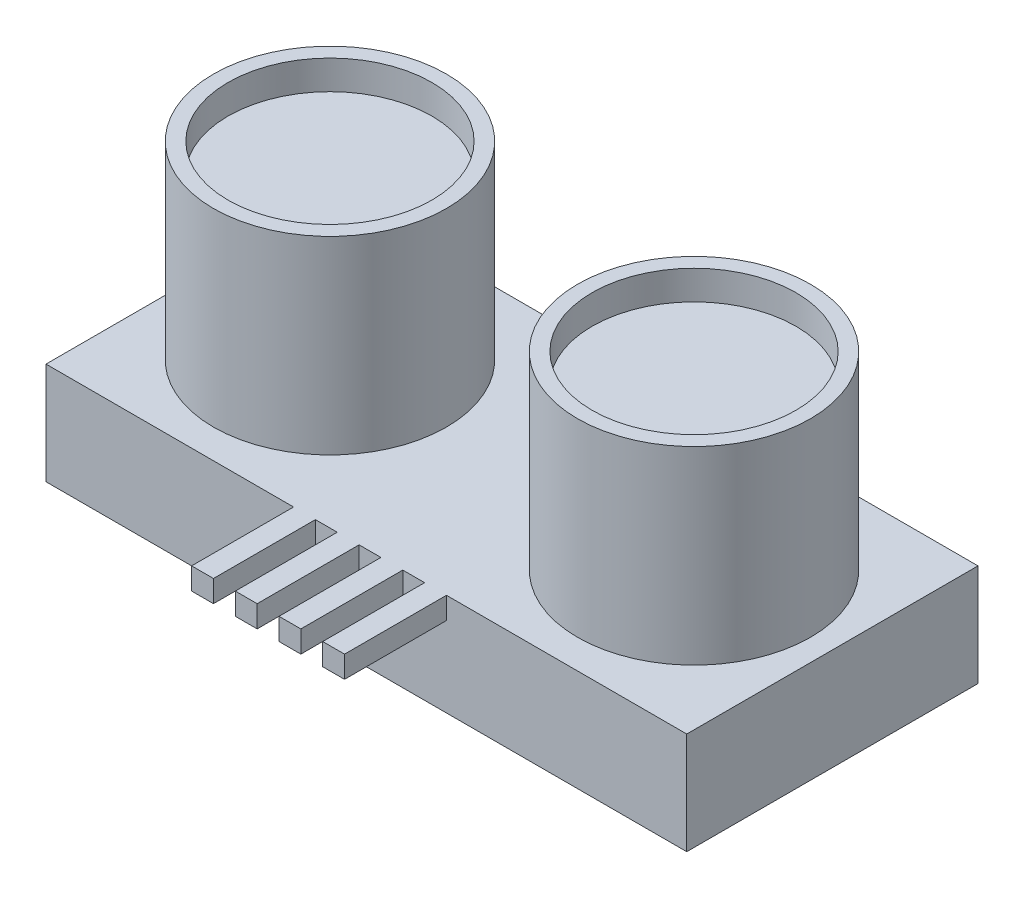
ISO-10303-21;
HEADER;
FILE_DESCRIPTION(('STEP AP214'),'2;1');
FILE_NAME('part.step','',(''),(''),'','','');
FILE_SCHEMA(('AUTOMOTIVE_DESIGN { 1 0 10303 214 1 1 1 1 }'));
ENDSEC;
DATA;
#1=APPLICATION_CONTEXT('core data for automotive mechanical design processes');
#2=APPLICATION_PROTOCOL_DEFINITION('international standard','automotive_design',2000,#1);
#3=PRODUCT_CONTEXT('',#1,'mechanical');
#4=PRODUCT('Part','Part','',(#3));
#5=PRODUCT_RELATED_PRODUCT_CATEGORY('part','',(#4));
#6=PRODUCT_DEFINITION_FORMATION('','',#4);
#7=PRODUCT_DEFINITION_CONTEXT('part definition',#1,'design');
#8=PRODUCT_DEFINITION('design','',#6,#7);
#9=PRODUCT_DEFINITION_SHAPE('','',#8);
#10=(LENGTH_UNIT() NAMED_UNIT(*) SI_UNIT(.MILLI.,.METRE.));
#11=(NAMED_UNIT(*) PLANE_ANGLE_UNIT() SI_UNIT($,.RADIAN.));
#12=(NAMED_UNIT(*) SI_UNIT($,.STERADIAN.) SOLID_ANGLE_UNIT());
#13=UNCERTAINTY_MEASURE_WITH_UNIT(LENGTH_MEASURE(1.E-05),#10,'distance_accuracy_value','');
#14=(GEOMETRIC_REPRESENTATION_CONTEXT(3) GLOBAL_UNCERTAINTY_ASSIGNED_CONTEXT((#13)) GLOBAL_UNIT_ASSIGNED_CONTEXT((#10,
#11,#12)) REPRESENTATION_CONTEXT('',''));
#15=CARTESIAN_POINT('',(0.,0.,0.));
#16=DIRECTION('',(0.,0.,1.));
#17=DIRECTION('',(1.,0.,0.));
#18=AXIS2_PLACEMENT_3D('',#15,#16,#17);
#19=CARTESIAN_POINT('',(-25.6809338521401,7.,4.84824902723736));
#20=DIRECTION('',(0.,0.,-1.));
#21=DIRECTION('',(-1.,0.,0.));
#22=AXIS2_PLACEMENT_3D('',#19,#20,#21);
#23=PLANE('',#22);
#24=DIRECTION('',(0.,-1.,0.));
#25=VECTOR('',#24,1.);
#26=CARTESIAN_POINT('',(0.319066147859932,7.,4.84824902723736));
#27=LINE('',#26,#25);
#28=CARTESIAN_POINT('',(0.319066147859932,7.,4.84824902723736));
#29=VERTEX_POINT('',#28);
#30=CARTESIAN_POINT('',(0.319066147859932,5.5,4.84824902723736));
#31=VERTEX_POINT('',#30);
#32=EDGE_CURVE('E196',#29,#31,#27,.T.);
#33=ORIENTED_EDGE('',*,*,#32,.F.);
#34=DIRECTION('',(1.,0.,0.));
#35=VECTOR('',#34,1.);
#36=CARTESIAN_POINT('',(-25.6809338521401,7.,4.84824902723736));
#37=LINE('',#36,#35);
#38=CARTESIAN_POINT('',(-1.18093385214007,7.,4.84824902723736));
#39=VERTEX_POINT('',#38);
#40=EDGE_CURVE('E285',#39,#29,#37,.T.);
#41=ORIENTED_EDGE('',*,*,#40,.F.);
#42=DIRECTION('',(0.,1.,0.));
#43=VECTOR('',#42,1.);
#44=CARTESIAN_POINT('',(-1.18093385214007,7.,4.84824902723736));
#45=LINE('',#44,#43);
#46=CARTESIAN_POINT('',(-1.18093385214007,5.5,4.84824902723736));
#47=VERTEX_POINT('',#46);
#48=EDGE_CURVE('E210',#47,#39,#45,.T.);
#49=ORIENTED_EDGE('',*,*,#48,.F.);
#50=DIRECTION('',(1.,0.,0.));
#51=VECTOR('',#50,1.);
#52=CARTESIAN_POINT('',(-2.68093385214007,5.5,4.84824902723736));
#53=LINE('',#52,#51);
#54=CARTESIAN_POINT('',(-2.68093385214007,5.5,4.84824902723736));
#55=VERTEX_POINT('',#54);
#56=EDGE_CURVE('E201',#55,#47,#53,.T.);
#57=ORIENTED_EDGE('',*,*,#56,.F.);
#58=DIRECTION('',(0.,-1.,0.));
#59=VECTOR('',#58,1.);
#60=CARTESIAN_POINT('',(-2.68093385214007,7.,4.84824902723736));
#61=LINE('',#60,#59);
#62=CARTESIAN_POINT('',(-2.68093385214007,7.,4.84824902723736));
#63=VERTEX_POINT('',#62);
#64=EDGE_CURVE('E198',#63,#55,#61,.T.);
#65=ORIENTED_EDGE('',*,*,#64,.F.);
#66=CARTESIAN_POINT('',(-4.18093385214007,7.,4.84824902723736));
#67=VERTEX_POINT('',#66);
#68=EDGE_CURVE('E282',#67,#63,#37,.T.);
#69=ORIENTED_EDGE('',*,*,#68,.F.);
#70=DIRECTION('',(0.,1.,0.));
#71=VECTOR('',#70,1.);
#72=CARTESIAN_POINT('',(-4.18093385214007,7.,4.84824902723736));
#73=LINE('',#72,#71);
#74=CARTESIAN_POINT('',(-4.18093385214007,5.5,4.84824902723736));
#75=VERTEX_POINT('',#74);
#76=EDGE_CURVE('E231',#75,#67,#73,.T.);
#77=ORIENTED_EDGE('',*,*,#76,.F.);
#78=DIRECTION('',(1.,0.,0.));
#79=VECTOR('',#78,1.);
#80=CARTESIAN_POINT('',(-5.68093385214007,5.5,4.84824902723736));
#81=LINE('',#80,#79);
#82=CARTESIAN_POINT('',(-5.68093385214007,5.5,4.84824902723736));
#83=VERTEX_POINT('',#82);
#84=EDGE_CURVE('E240',#83,#75,#81,.T.);
#85=ORIENTED_EDGE('',*,*,#84,.F.);
#86=DIRECTION('',(0.,-1.,0.));
#87=VECTOR('',#86,1.);
#88=CARTESIAN_POINT('',(-5.68093385214007,7.,4.84824902723736));
#89=LINE('',#88,#87);
#90=CARTESIAN_POINT('',(-5.68093385214007,7.,4.84824902723736));
#91=VERTEX_POINT('',#90);
#92=EDGE_CURVE('E226',#91,#83,#89,.T.);
#93=ORIENTED_EDGE('',*,*,#92,.F.);
#94=CARTESIAN_POINT('',(-7.18093385214007,7.,4.84824902723736));
#95=VERTEX_POINT('',#94);
#96=EDGE_CURVE('E284',#95,#91,#37,.T.);
#97=ORIENTED_EDGE('',*,*,#96,.F.);
#98=DIRECTION('',(0.,1.,0.));
#99=VECTOR('',#98,1.);
#100=CARTESIAN_POINT('',(-7.18093385214007,7.,4.84824902723736));
#101=LINE('',#100,#99);
#102=CARTESIAN_POINT('',(-7.18093385214007,5.5,4.84824902723736));
#103=VERTEX_POINT('',#102);
#104=EDGE_CURVE('E257',#103,#95,#101,.T.);
#105=ORIENTED_EDGE('',*,*,#104,.F.);
#106=DIRECTION('',(1.,0.,0.));
#107=VECTOR('',#106,1.);
#108=CARTESIAN_POINT('',(-8.68093385214007,5.5,4.84824902723736));
#109=LINE('',#108,#107);
#110=CARTESIAN_POINT('',(-8.68093385214007,5.5,4.84824902723736));
#111=VERTEX_POINT('',#110);
#112=EDGE_CURVE('E264',#111,#103,#109,.T.);
#113=ORIENTED_EDGE('',*,*,#112,.F.);
#114=DIRECTION('',(0.,-1.,0.));
#115=VECTOR('',#114,1.);
#116=CARTESIAN_POINT('',(-8.68093385214007,7.,4.84824902723736));
#117=LINE('',#116,#115);
#118=CARTESIAN_POINT('',(-8.68093385214007,7.,4.84824902723736));
#119=VERTEX_POINT('',#118);
#120=EDGE_CURVE('E252',#119,#111,#117,.T.);
#121=ORIENTED_EDGE('',*,*,#120,.F.);
#122=CARTESIAN_POINT('',(-25.6809338521401,7.,4.84824902723736));
#123=VERTEX_POINT('',#122);
#124=EDGE_CURVE('E300',#123,#119,#37,.T.);
#125=ORIENTED_EDGE('',*,*,#124,.F.);
#126=DIRECTION('',(0.,-1.,0.));
#127=VECTOR('',#126,1.);
#128=CARTESIAN_POINT('',(-25.6809338521401,7.,4.84824902723736));
#129=LINE('',#128,#127);
#130=CARTESIAN_POINT('',(-25.6809338521401,0.,4.84824902723736));
#131=VERTEX_POINT('',#130);
#132=EDGE_CURVE('E11',#123,#131,#129,.T.);
#133=ORIENTED_EDGE('',*,*,#132,.T.);
#134=DIRECTION('',(1.,0.,0.));
#135=VECTOR('',#134,1.);
#136=CARTESIAN_POINT('',(-25.6809338521401,0.,4.84824902723736));
#137=LINE('',#136,#135);
#138=CARTESIAN_POINT('',(18.3190661478599,0.,4.84824902723736));
#139=VERTEX_POINT('',#138);
#140=EDGE_CURVE('E316',#131,#139,#137,.T.);
#141=ORIENTED_EDGE('',*,*,#140,.T.);
#142=DIRECTION('',(0.,-1.,0.));
#143=VECTOR('',#142,1.);
#144=CARTESIAN_POINT('',(18.3190661478599,7.,4.84824902723736));
#145=LINE('',#144,#143);
#146=CARTESIAN_POINT('',(18.3190661478599,7.,4.84824902723736));
#147=VERTEX_POINT('',#146);
#148=EDGE_CURVE('E43',#147,#139,#145,.T.);
#149=ORIENTED_EDGE('',*,*,#148,.F.);
#150=CARTESIAN_POINT('',(1.81906614785993,7.,4.84824902723736));
#151=VERTEX_POINT('',#150);
#152=EDGE_CURVE('E37',#151,#147,#37,.T.);
#153=ORIENTED_EDGE('',*,*,#152,.F.);
#154=DIRECTION('',(0.,1.,0.));
#155=VECTOR('',#154,1.);
#156=CARTESIAN_POINT('',(1.81906614785993,7.,4.84824902723736));
#157=LINE('',#156,#155);
#158=CARTESIAN_POINT('',(1.81906614785993,5.5,4.84824902723736));
#159=VERTEX_POINT('',#158);
#160=EDGE_CURVE('E192',#159,#151,#157,.T.);
#161=ORIENTED_EDGE('',*,*,#160,.F.);
#162=DIRECTION('',(1.,0.,0.));
#163=VECTOR('',#162,1.);
#164=CARTESIAN_POINT('',(0.319066147859932,5.5,4.84824902723736));
#165=LINE('',#164,#163);
#166=EDGE_CURVE('E346',#31,#159,#165,.T.);
#167=ORIENTED_EDGE('',*,*,#166,.F.);
#168=EDGE_LOOP('',(#33,#41,#49,#57,#65,#69,#77,#85,#93,#97,#105,#113,#121,#125,#133,#141,#149,
#153,#161,#167));
#169=FACE_BOUND('',#168,.T.);
#170=ADVANCED_FACE('F33',(#169),#23,.F.);
#171=CARTESIAN_POINT('',(0.,7.,0.));
#172=DIRECTION('',(0.,1.,0.));
#173=DIRECTION('',(0.,0.,1.));
#174=AXIS2_PLACEMENT_3D('',#171,#172,#173);
#175=PLANE('',#174);
#176=CARTESIAN_POINT('',(-16.1809338521401,7.,-5.15175097276264));
#177=DIRECTION('',(0.,1.,0.));
#178=DIRECTION('',(0.,0.,1.));
#179=AXIS2_PLACEMENT_3D('',#176,#177,#178);
#180=CIRCLE('',#179,8.);
#181=CARTESIAN_POINT('',(-16.1809338521401,7.,2.84824902723736));
#182=VERTEX_POINT('',#181);
#183=EDGE_CURVE('E399',#182,#182,#180,.T.);
#184=ORIENTED_EDGE('',*,*,#183,.F.);
#185=EDGE_LOOP('',(#184));
#186=FACE_BOUND('',#185,.T.);
#187=DIRECTION('',(0.,0.,1.));
#188=VECTOR('',#187,1.);
#189=CARTESIAN_POINT('',(-25.6809338521401,7.,-15.1517509727626));
#190=LINE('',#189,#188);
#191=CARTESIAN_POINT('',(-25.6809338521401,7.,-15.1517509727626));
#192=VERTEX_POINT('',#191);
#193=EDGE_CURVE('E289',#192,#123,#190,.T.);
#194=ORIENTED_EDGE('',*,*,#193,.T.);
#195=ORIENTED_EDGE('',*,*,#124,.T.);
#196=DIRECTION('',(0.,0.,-1.));
#197=VECTOR('',#196,1.);
#198=CARTESIAN_POINT('',(-8.68093385214007,7.,11.8482490272374));
#199=LINE('',#198,#197);
#200=CARTESIAN_POINT('',(-8.68093385214007,7.,11.8482490272374));
#201=VERTEX_POINT('',#200);
#202=EDGE_CURVE('E263',#201,#119,#199,.T.);
#203=ORIENTED_EDGE('',*,*,#202,.F.);
#204=DIRECTION('',(-1.,0.,0.));
#205=VECTOR('',#204,1.);
#206=CARTESIAN_POINT('',(-8.68093385214007,7.,11.8482490272374));
#207=LINE('',#206,#205);
#208=CARTESIAN_POINT('',(-7.18093385214007,7.,11.8482490272374));
#209=VERTEX_POINT('',#208);
#210=EDGE_CURVE('E261',#209,#201,#207,.T.);
#211=ORIENTED_EDGE('',*,*,#210,.F.);
#212=DIRECTION('',(0.,0.,-1.));
#213=VECTOR('',#212,1.);
#214=CARTESIAN_POINT('',(-7.18093385214007,7.,11.8482490272374));
#215=LINE('',#214,#213);
#216=EDGE_CURVE('E277',#209,#95,#215,.T.);
#217=ORIENTED_EDGE('',*,*,#216,.T.);
#218=ORIENTED_EDGE('',*,*,#96,.T.);
#219=DIRECTION('',(0.,0.,-1.));
#220=VECTOR('',#219,1.);
#221=CARTESIAN_POINT('',(-5.68093385214007,7.,11.8482490272374));
#222=LINE('',#221,#220);
#223=CARTESIAN_POINT('',(-5.68093385214007,7.,11.8482490272374));
#224=VERTEX_POINT('',#223);
#225=EDGE_CURVE('E237',#224,#91,#222,.T.);
#226=ORIENTED_EDGE('',*,*,#225,.F.);
#227=DIRECTION('',(-1.,0.,0.));
#228=VECTOR('',#227,1.);
#229=CARTESIAN_POINT('',(-5.68093385214007,7.,11.8482490272374));
#230=LINE('',#229,#228);
#231=CARTESIAN_POINT('',(-4.18093385214007,7.,11.8482490272374));
#232=VERTEX_POINT('',#231);
#233=EDGE_CURVE('E235',#232,#224,#230,.T.);
#234=ORIENTED_EDGE('',*,*,#233,.F.);
#235=DIRECTION('',(0.,0.,-1.));
#236=VECTOR('',#235,1.);
#237=CARTESIAN_POINT('',(-4.18093385214007,7.,11.8482490272374));
#238=LINE('',#237,#236);
#239=EDGE_CURVE('E245',#232,#67,#238,.T.);
#240=ORIENTED_EDGE('',*,*,#239,.T.);
#241=ORIENTED_EDGE('',*,*,#68,.T.);
#242=DIRECTION('',(0.,0.,-1.));
#243=VECTOR('',#242,1.);
#244=CARTESIAN_POINT('',(-2.68093385214007,7.,11.8482490272374));
#245=LINE('',#244,#243);
#246=CARTESIAN_POINT('',(-2.68093385214007,7.,11.8482490272374));
#247=VERTEX_POINT('',#246);
#248=EDGE_CURVE('E215',#247,#63,#245,.T.);
#249=ORIENTED_EDGE('',*,*,#248,.F.);
#250=DIRECTION('',(-1.,0.,0.));
#251=VECTOR('',#250,1.);
#252=CARTESIAN_POINT('',(-2.68093385214007,7.,11.8482490272374));
#253=LINE('',#252,#251);
#254=CARTESIAN_POINT('',(-1.18093385214007,7.,11.8482490272374));
#255=VERTEX_POINT('',#254);
#256=EDGE_CURVE('E214',#255,#247,#253,.T.);
#257=ORIENTED_EDGE('',*,*,#256,.F.);
#258=DIRECTION('',(0.,0.,-1.));
#259=VECTOR('',#258,1.);
#260=CARTESIAN_POINT('',(-1.18093385214007,7.,11.8482490272374));
#261=LINE('',#260,#259);
#262=EDGE_CURVE('E58',#255,#39,#261,.T.);
#263=ORIENTED_EDGE('',*,*,#262,.T.);
#264=ORIENTED_EDGE('',*,*,#40,.T.);
#265=DIRECTION('',(0.,0.,-1.));
#266=VECTOR('',#265,1.);
#267=CARTESIAN_POINT('',(0.319066147859932,7.,11.8482490272374));
#268=LINE('',#267,#266);
#269=CARTESIAN_POINT('',(0.319066147859932,7.,11.8482490272374));
#270=VERTEX_POINT('',#269);
#271=EDGE_CURVE('E341',#270,#29,#268,.T.);
#272=ORIENTED_EDGE('',*,*,#271,.F.);
#273=DIRECTION('',(-1.,0.,0.));
#274=VECTOR('',#273,1.);
#275=CARTESIAN_POINT('',(0.319066147859932,7.,11.8482490272374));
#276=LINE('',#275,#274);
#277=CARTESIAN_POINT('',(1.81906614785993,7.,11.8482490272374));
#278=VERTEX_POINT('',#277);
#279=EDGE_CURVE('E189',#278,#270,#276,.T.);
#280=ORIENTED_EDGE('',*,*,#279,.F.);
#281=DIRECTION('',(0.,0.,-1.));
#282=VECTOR('',#281,1.);
#283=CARTESIAN_POINT('',(1.81906614785993,7.,11.8482490272374));
#284=LINE('',#283,#282);
#285=EDGE_CURVE('E51',#278,#151,#284,.T.);
#286=ORIENTED_EDGE('',*,*,#285,.T.);
#287=ORIENTED_EDGE('',*,*,#152,.T.);
#288=DIRECTION('',(0.,0.,-1.));
#289=VECTOR('',#288,1.);
#290=CARTESIAN_POINT('',(18.3190661478599,7.,-15.1517509727626));
#291=LINE('',#290,#289);
#292=CARTESIAN_POINT('',(18.3190661478599,7.,-15.1517509727626));
#293=VERTEX_POINT('',#292);
#294=EDGE_CURVE('E291',#147,#293,#291,.T.);
#295=ORIENTED_EDGE('',*,*,#294,.T.);
#296=DIRECTION('',(-1.,0.,0.));
#297=VECTOR('',#296,1.);
#298=CARTESIAN_POINT('',(-25.6809338521401,7.,-15.1517509727626));
#299=LINE('',#298,#297);
#300=EDGE_CURVE('E311',#293,#192,#299,.T.);
#301=ORIENTED_EDGE('',*,*,#300,.T.);
#302=EDGE_LOOP('',(#194,#195,#203,#211,#217,#218,#226,#234,#240,#241,#249,#257,#263,#264,#272,
#280,#286,#287,#295,#301));
#303=FACE_BOUND('',#302,.T.);
#304=CARTESIAN_POINT('',(8.81906614785993,7.,-5.15175097276264));
#305=DIRECTION('',(0.,1.,0.));
#306=DIRECTION('',(0.,0.,1.));
#307=AXIS2_PLACEMENT_3D('',#304,#305,#306);
#308=CIRCLE('',#307,8.00000000000001);
#309=CARTESIAN_POINT('',(8.81906614785993,7.,2.84824902723736));
#310=VERTEX_POINT('',#309);
#311=EDGE_CURVE('E393',#310,#310,#308,.T.);
#312=ORIENTED_EDGE('',*,*,#311,.F.);
#313=EDGE_LOOP('',(#312));
#314=FACE_BOUND('',#313,.T.);
#315=ADVANCED_FACE('F326',(#186,#303,#314),#175,.T.);
#316=CARTESIAN_POINT('',(-25.6809338521401,7.,-15.1517509727626));
#317=DIRECTION('',(1.,0.,0.));
#318=DIRECTION('',(0.,0.,-1.));
#319=AXIS2_PLACEMENT_3D('',#316,#317,#318);
#320=PLANE('',#319);
#321=DIRECTION('',(0.,0.,1.));
#322=VECTOR('',#321,1.);
#323=CARTESIAN_POINT('',(-25.6809338521401,0.,-15.1517509727626));
#324=LINE('',#323,#322);
#325=CARTESIAN_POINT('',(-25.6809338521401,0.,-15.1517509727626));
#326=VERTEX_POINT('',#325);
#327=EDGE_CURVE('E318',#326,#131,#324,.T.);
#328=ORIENTED_EDGE('',*,*,#327,.T.);
#329=ORIENTED_EDGE('',*,*,#132,.F.);
#330=ORIENTED_EDGE('',*,*,#193,.F.);
#331=DIRECTION('',(0.,-1.,0.));
#332=VECTOR('',#331,1.);
#333=CARTESIAN_POINT('',(-25.6809338521401,7.,-15.1517509727626));
#334=LINE('',#333,#332);
#335=EDGE_CURVE('E308',#192,#326,#334,.T.);
#336=ORIENTED_EDGE('',*,*,#335,.T.);
#337=EDGE_LOOP('',(#328,#329,#330,#336));
#338=FACE_BOUND('',#337,.T.);
#339=ADVANCED_FACE('F35',(#338),#320,.F.);
#340=CARTESIAN_POINT('',(18.3190661478599,7.,-15.1517509727626));
#341=DIRECTION('',(-1.,0.,0.));
#342=DIRECTION('',(0.,0.,1.));
#343=AXIS2_PLACEMENT_3D('',#340,#341,#342);
#344=PLANE('',#343);
#345=DIRECTION('',(0.,0.,-1.));
#346=VECTOR('',#345,1.);
#347=CARTESIAN_POINT('',(18.3190661478599,0.,-15.1517509727626));
#348=LINE('',#347,#346);
#349=CARTESIAN_POINT('',(18.3190661478599,0.,-15.1517509727626));
#350=VERTEX_POINT('',#349);
#351=EDGE_CURVE('E314',#139,#350,#348,.T.);
#352=ORIENTED_EDGE('',*,*,#351,.T.);
#353=DIRECTION('',(0.,-1.,0.));
#354=VECTOR('',#353,1.);
#355=CARTESIAN_POINT('',(18.3190661478599,7.,-15.1517509727626));
#356=LINE('',#355,#354);
#357=EDGE_CURVE('E305',#293,#350,#356,.T.);
#358=ORIENTED_EDGE('',*,*,#357,.F.);
#359=ORIENTED_EDGE('',*,*,#294,.F.);
#360=ORIENTED_EDGE('',*,*,#148,.T.);
#361=EDGE_LOOP('',(#352,#358,#359,#360));
#362=FACE_BOUND('',#361,.T.);
#363=ADVANCED_FACE('F331',(#362),#344,.F.);
#364=CARTESIAN_POINT('',(-25.6809338521401,7.,-15.1517509727626));
#365=DIRECTION('',(0.,0.,1.));
#366=DIRECTION('',(1.,0.,0.));
#367=AXIS2_PLACEMENT_3D('',#364,#365,#366);
#368=PLANE('',#367);
#369=DIRECTION('',(-1.,0.,0.));
#370=VECTOR('',#369,1.);
#371=CARTESIAN_POINT('',(-25.6809338521401,0.,-15.1517509727626));
#372=LINE('',#371,#370);
#373=EDGE_CURVE('E312',#350,#326,#372,.T.);
#374=ORIENTED_EDGE('',*,*,#373,.T.);
#375=ORIENTED_EDGE('',*,*,#335,.F.);
#376=ORIENTED_EDGE('',*,*,#300,.F.);
#377=ORIENTED_EDGE('',*,*,#357,.T.);
#378=EDGE_LOOP('',(#374,#375,#376,#377));
#379=FACE_BOUND('',#378,.T.);
#380=ADVANCED_FACE('F335',(#379),#368,.F.);
#381=CARTESIAN_POINT('',(0.,0.,0.));
#382=DIRECTION('',(0.,1.,0.));
#383=DIRECTION('',(0.,0.,1.));
#384=AXIS2_PLACEMENT_3D('',#381,#382,#383);
#385=PLANE('',#384);
#386=ORIENTED_EDGE('',*,*,#327,.F.);
#387=ORIENTED_EDGE('',*,*,#373,.F.);
#388=ORIENTED_EDGE('',*,*,#351,.F.);
#389=ORIENTED_EDGE('',*,*,#140,.F.);
#390=EDGE_LOOP('',(#386,#387,#388,#389));
#391=FACE_BOUND('',#390,.T.);
#392=ADVANCED_FACE('F356',(#391),#385,.F.);
#393=CARTESIAN_POINT('',(-16.1809338521401,20.,-5.15175097276264));
#394=DIRECTION('',(0.,-1.,0.));
#395=DIRECTION('',(0.,0.,-1.));
#396=AXIS2_PLACEMENT_3D('',#393,#394,#395);
#397=CYLINDRICAL_SURFACE('',#396,8.);
#398=CARTESIAN_POINT('',(-16.1809338521401,20.,-5.15175097276264));
#399=DIRECTION('',(0.,1.,0.));
#400=DIRECTION('',(0.,0.,1.));
#401=AXIS2_PLACEMENT_3D('',#398,#399,#400);
#402=CIRCLE('',#401,8.);
#403=CARTESIAN_POINT('',(-16.1809338521401,20.,2.84824902723736));
#404=VERTEX_POINT('',#403);
#405=EDGE_CURVE('E320',#404,#404,#402,.T.);
#406=ORIENTED_EDGE('',*,*,#405,.F.);
#407=EDGE_LOOP('',(#406));
#408=FACE_BOUND('',#407,.T.);
#409=ORIENTED_EDGE('',*,*,#183,.T.);
#410=EDGE_LOOP('',(#409));
#411=FACE_BOUND('',#410,.T.);
#412=ADVANCED_FACE('F406',(#408,#411),#397,.T.);
#413=CARTESIAN_POINT('',(-16.1809338521401,20.,-5.15175097276264));
#414=DIRECTION('',(0.,1.,0.));
#415=DIRECTION('',(0.,0.,1.));
#416=AXIS2_PLACEMENT_3D('',#413,#414,#415);
#417=PLANE('',#416);
#418=CARTESIAN_POINT('',(-16.1809338521401,20.,-5.15175097276264));
#419=DIRECTION('',(0.,1.,0.));
#420=DIRECTION('',(0.,0.,1.));
#421=AXIS2_PLACEMENT_3D('',#418,#419,#420);
#422=CIRCLE('',#421,7.);
#423=CARTESIAN_POINT('',(-16.1809338521401,20.,1.84824902723736));
#424=VERTEX_POINT('',#423);
#425=EDGE_CURVE('E388',#424,#424,#422,.T.);
#426=ORIENTED_EDGE('',*,*,#425,.F.);
#427=EDGE_LOOP('',(#426));
#428=FACE_BOUND('',#427,.T.);
#429=ORIENTED_EDGE('',*,*,#405,.T.);
#430=EDGE_LOOP('',(#429));
#431=FACE_BOUND('',#430,.T.);
#432=ADVANCED_FACE('F440',(#428,#431),#417,.T.);
#433=CARTESIAN_POINT('',(8.81906614785993,20.,-5.15175097276264));
#434=DIRECTION('',(0.,-1.,0.));
#435=DIRECTION('',(0.,0.,-1.));
#436=AXIS2_PLACEMENT_3D('',#433,#434,#435);
#437=CYLINDRICAL_SURFACE('',#436,8.00000000000001);
#438=CARTESIAN_POINT('',(8.81906614785993,20.,-5.15175097276264));
#439=DIRECTION('',(0.,1.,0.));
#440=DIRECTION('',(0.,0.,1.));
#441=AXIS2_PLACEMENT_3D('',#438,#439,#440);
#442=CIRCLE('',#441,8.00000000000001);
#443=CARTESIAN_POINT('',(8.81906614785993,20.,2.84824902723736));
#444=VERTEX_POINT('',#443);
#445=EDGE_CURVE('E396',#444,#444,#442,.T.);
#446=ORIENTED_EDGE('',*,*,#445,.F.);
#447=EDGE_LOOP('',(#446));
#448=FACE_BOUND('',#447,.T.);
#449=ORIENTED_EDGE('',*,*,#311,.T.);
#450=EDGE_LOOP('',(#449));
#451=FACE_BOUND('',#450,.T.);
#452=ADVANCED_FACE('F448',(#448,#451),#437,.T.);
#453=CARTESIAN_POINT('',(8.81906614785993,20.,-5.15175097276264));
#454=DIRECTION('',(0.,1.,0.));
#455=DIRECTION('',(0.,0.,1.));
#456=AXIS2_PLACEMENT_3D('',#453,#454,#455);
#457=PLANE('',#456);
#458=CARTESIAN_POINT('',(8.81906614785993,20.,-5.15175097276264));
#459=DIRECTION('',(0.,1.,0.));
#460=DIRECTION('',(0.,0.,1.));
#461=AXIS2_PLACEMENT_3D('',#458,#459,#460);
#462=CIRCLE('',#461,7.);
#463=CARTESIAN_POINT('',(8.81906614785993,20.,1.84824902723736));
#464=VERTEX_POINT('',#463);
#465=EDGE_CURVE('E382',#464,#464,#462,.T.);
#466=ORIENTED_EDGE('',*,*,#465,.F.);
#467=EDGE_LOOP('',(#466));
#468=FACE_BOUND('',#467,.T.);
#469=ORIENTED_EDGE('',*,*,#445,.T.);
#470=EDGE_LOOP('',(#469));
#471=FACE_BOUND('',#470,.T.);
#472=ADVANCED_FACE('F455',(#468,#471),#457,.T.);
#473=CARTESIAN_POINT('',(-16.1809338521401,18.,-5.15175097276264));
#474=DIRECTION('',(0.,1.,0.));
#475=DIRECTION('',(0.,0.,1.));
#476=AXIS2_PLACEMENT_3D('',#473,#474,#475);
#477=CYLINDRICAL_SURFACE('',#476,7.);
#478=CARTESIAN_POINT('',(-16.1809338521401,18.,-5.15175097276264));
#479=DIRECTION('',(0.,1.,0.));
#480=DIRECTION('',(0.,0.,1.));
#481=AXIS2_PLACEMENT_3D('',#478,#479,#480);
#482=CIRCLE('',#481,7.);
#483=CARTESIAN_POINT('',(-16.1809338521401,18.,1.84824902723736));
#484=VERTEX_POINT('',#483);
#485=EDGE_CURVE('E390',#484,#484,#482,.T.);
#486=ORIENTED_EDGE('',*,*,#485,.F.);
#487=EDGE_LOOP('',(#486));
#488=FACE_BOUND('',#487,.T.);
#489=ORIENTED_EDGE('',*,*,#425,.T.);
#490=EDGE_LOOP('',(#489));
#491=FACE_BOUND('',#490,.T.);
#492=ADVANCED_FACE('F462',(#488,#491),#477,.F.);
#493=CARTESIAN_POINT('',(-16.1809338521401,18.,-5.15175097276264));
#494=DIRECTION('',(0.,1.,0.));
#495=DIRECTION('',(0.,0.,1.));
#496=AXIS2_PLACEMENT_3D('',#493,#494,#495);
#497=PLANE('',#496);
#498=ORIENTED_EDGE('',*,*,#485,.T.);
#499=EDGE_LOOP('',(#498));
#500=FACE_BOUND('',#499,.T.);
#501=ADVANCED_FACE('F470',(#500),#497,.T.);
#502=CARTESIAN_POINT('',(8.81906614785993,18.,-5.15175097276264));
#503=DIRECTION('',(0.,1.,0.));
#504=DIRECTION('',(0.,0.,1.));
#505=AXIS2_PLACEMENT_3D('',#502,#503,#504);
#506=CYLINDRICAL_SURFACE('',#505,7.);
#507=CARTESIAN_POINT('',(8.81906614785993,18.,-5.15175097276264));
#508=DIRECTION('',(0.,1.,0.));
#509=DIRECTION('',(0.,0.,1.));
#510=AXIS2_PLACEMENT_3D('',#507,#508,#509);
#511=CIRCLE('',#510,7.);
#512=CARTESIAN_POINT('',(8.81906614785993,18.,1.84824902723736));
#513=VERTEX_POINT('',#512);
#514=EDGE_CURVE('E384',#513,#513,#511,.T.);
#515=ORIENTED_EDGE('',*,*,#514,.F.);
#516=EDGE_LOOP('',(#515));
#517=FACE_BOUND('',#516,.T.);
#518=ORIENTED_EDGE('',*,*,#465,.T.);
#519=EDGE_LOOP('',(#518));
#520=FACE_BOUND('',#519,.T.);
#521=ADVANCED_FACE('F478',(#517,#520),#506,.F.);
#522=CARTESIAN_POINT('',(8.81906614785993,18.,-5.15175097276264));
#523=DIRECTION('',(0.,1.,0.));
#524=DIRECTION('',(0.,0.,1.));
#525=AXIS2_PLACEMENT_3D('',#522,#523,#524);
#526=PLANE('',#525);
#527=ORIENTED_EDGE('',*,*,#514,.T.);
#528=EDGE_LOOP('',(#527));
#529=FACE_BOUND('',#528,.T.);
#530=ADVANCED_FACE('F486',(#529),#526,.T.);
#531=CARTESIAN_POINT('',(-8.68093385214007,7.,11.8482490272374));
#532=DIRECTION('',(1.,0.,0.));
#533=DIRECTION('',(0.,0.,-1.));
#534=AXIS2_PLACEMENT_3D('',#531,#532,#533);
#535=PLANE('',#534);
#536=ORIENTED_EDGE('',*,*,#120,.T.);
#537=DIRECTION('',(0.,0.,-1.));
#538=VECTOR('',#537,1.);
#539=CARTESIAN_POINT('',(-8.68093385214007,5.5,11.8482490272374));
#540=LINE('',#539,#538);
#541=CARTESIAN_POINT('',(-8.68093385214007,5.5,11.8482490272374));
#542=VERTEX_POINT('',#541);
#543=EDGE_CURVE('E368',#542,#111,#540,.T.);
#544=ORIENTED_EDGE('',*,*,#543,.F.);
#545=DIRECTION('',(0.,-1.,0.));
#546=VECTOR('',#545,1.);
#547=CARTESIAN_POINT('',(-8.68093385214007,7.,11.8482490272374));
#548=LINE('',#547,#546);
#549=EDGE_CURVE('E253',#201,#542,#548,.T.);
#550=ORIENTED_EDGE('',*,*,#549,.F.);
#551=ORIENTED_EDGE('',*,*,#202,.T.);
#552=EDGE_LOOP('',(#536,#544,#550,#551));
#553=FACE_BOUND('',#552,.T.);
#554=ADVANCED_FACE('F363',(#553),#535,.F.);
#555=CARTESIAN_POINT('',(-8.68093385214007,5.5,11.8482490272374));
#556=DIRECTION('',(0.,1.,0.));
#557=DIRECTION('',(0.,0.,1.));
#558=AXIS2_PLACEMENT_3D('',#555,#556,#557);
#559=PLANE('',#558);
#560=ORIENTED_EDGE('',*,*,#112,.T.);
#561=DIRECTION('',(0.,0.,-1.));
#562=VECTOR('',#561,1.);
#563=CARTESIAN_POINT('',(-7.18093385214007,5.5,11.8482490272374));
#564=LINE('',#563,#562);
#565=CARTESIAN_POINT('',(-7.18093385214007,5.5,11.8482490272374));
#566=VERTEX_POINT('',#565);
#567=EDGE_CURVE('E269',#566,#103,#564,.T.);
#568=ORIENTED_EDGE('',*,*,#567,.F.);
#569=DIRECTION('',(1.,0.,0.));
#570=VECTOR('',#569,1.);
#571=CARTESIAN_POINT('',(-8.68093385214007,5.5,11.8482490272374));
#572=LINE('',#571,#570);
#573=EDGE_CURVE('E256',#542,#566,#572,.T.);
#574=ORIENTED_EDGE('',*,*,#573,.F.);
#575=ORIENTED_EDGE('',*,*,#543,.T.);
#576=EDGE_LOOP('',(#560,#568,#574,#575));
#577=FACE_BOUND('',#576,.T.);
#578=ADVANCED_FACE('F381',(#577),#559,.F.);
#579=CARTESIAN_POINT('',(-7.18093385214007,7.,11.8482490272374));
#580=DIRECTION('',(-1.,0.,0.));
#581=DIRECTION('',(0.,0.,1.));
#582=AXIS2_PLACEMENT_3D('',#579,#580,#581);
#583=PLANE('',#582);
#584=ORIENTED_EDGE('',*,*,#104,.T.);
#585=ORIENTED_EDGE('',*,*,#216,.F.);
#586=DIRECTION('',(0.,1.,0.));
#587=VECTOR('',#586,1.);
#588=CARTESIAN_POINT('',(-7.18093385214007,7.,11.8482490272374));
#589=LINE('',#588,#587);
#590=EDGE_CURVE('E259',#566,#209,#589,.T.);
#591=ORIENTED_EDGE('',*,*,#590,.F.);
#592=ORIENTED_EDGE('',*,*,#567,.T.);
#593=EDGE_LOOP('',(#584,#585,#591,#592));
#594=FACE_BOUND('',#593,.T.);
#595=ADVANCED_FACE('F377',(#594),#583,.F.);
#596=CARTESIAN_POINT('',(0.,0.,11.8482490272374));
#597=DIRECTION('',(0.,0.,1.));
#598=DIRECTION('',(1.,0.,0.));
#599=AXIS2_PLACEMENT_3D('',#596,#597,#598);
#600=PLANE('',#599);
#601=ORIENTED_EDGE('',*,*,#549,.T.);
#602=ORIENTED_EDGE('',*,*,#573,.T.);
#603=ORIENTED_EDGE('',*,*,#590,.T.);
#604=ORIENTED_EDGE('',*,*,#210,.T.);
#605=EDGE_LOOP('',(#601,#602,#603,#604));
#606=FACE_BOUND('',#605,.T.);
#607=ADVANCED_FACE('F370',(#606),#600,.T.);
#608=CARTESIAN_POINT('',(-5.68093385214007,7.,11.8482490272374));
#609=DIRECTION('',(1.,0.,0.));
#610=DIRECTION('',(0.,0.,-1.));
#611=AXIS2_PLACEMENT_3D('',#608,#609,#610);
#612=PLANE('',#611);
#613=ORIENTED_EDGE('',*,*,#92,.T.);
#614=DIRECTION('',(0.,0.,-1.));
#615=VECTOR('',#614,1.);
#616=CARTESIAN_POINT('',(-5.68093385214007,5.5,11.8482490272374));
#617=LINE('',#616,#615);
#618=CARTESIAN_POINT('',(-5.68093385214007,5.5,11.8482490272374));
#619=VERTEX_POINT('',#618);
#620=EDGE_CURVE('E250',#619,#83,#617,.T.);
#621=ORIENTED_EDGE('',*,*,#620,.F.);
#622=DIRECTION('',(0.,-1.,0.));
#623=VECTOR('',#622,1.);
#624=CARTESIAN_POINT('',(-5.68093385214007,7.,11.8482490272374));
#625=LINE('',#624,#623);
#626=EDGE_CURVE('E227',#224,#619,#625,.T.);
#627=ORIENTED_EDGE('',*,*,#626,.F.);
#628=ORIENTED_EDGE('',*,*,#225,.T.);
#629=EDGE_LOOP('',(#613,#621,#627,#628));
#630=FACE_BOUND('',#629,.T.);
#631=ADVANCED_FACE('F520',(#630),#612,.F.);
#632=CARTESIAN_POINT('',(-5.68093385214007,5.5,11.8482490272374));
#633=DIRECTION('',(0.,1.,0.));
#634=DIRECTION('',(0.,0.,1.));
#635=AXIS2_PLACEMENT_3D('',#632,#633,#634);
#636=PLANE('',#635);
#637=ORIENTED_EDGE('',*,*,#84,.T.);
#638=DIRECTION('',(0.,0.,-1.));
#639=VECTOR('',#638,1.);
#640=CARTESIAN_POINT('',(-4.18093385214007,5.5,11.8482490272374));
#641=LINE('',#640,#639);
#642=CARTESIAN_POINT('',(-4.18093385214007,5.5,11.8482490272374));
#643=VERTEX_POINT('',#642);
#644=EDGE_CURVE('E247',#643,#75,#641,.T.);
#645=ORIENTED_EDGE('',*,*,#644,.F.);
#646=DIRECTION('',(1.,0.,0.));
#647=VECTOR('',#646,1.);
#648=CARTESIAN_POINT('',(-5.68093385214007,5.5,11.8482490272374));
#649=LINE('',#648,#647);
#650=EDGE_CURVE('E230',#619,#643,#649,.T.);
#651=ORIENTED_EDGE('',*,*,#650,.F.);
#652=ORIENTED_EDGE('',*,*,#620,.T.);
#653=EDGE_LOOP('',(#637,#645,#651,#652));
#654=FACE_BOUND('',#653,.T.);
#655=ADVANCED_FACE('F527',(#654),#636,.F.);
#656=CARTESIAN_POINT('',(-4.18093385214007,7.,11.8482490272374));
#657=DIRECTION('',(-1.,0.,0.));
#658=DIRECTION('',(0.,0.,1.));
#659=AXIS2_PLACEMENT_3D('',#656,#657,#658);
#660=PLANE('',#659);
#661=ORIENTED_EDGE('',*,*,#76,.T.);
#662=ORIENTED_EDGE('',*,*,#239,.F.);
#663=DIRECTION('',(0.,1.,0.));
#664=VECTOR('',#663,1.);
#665=CARTESIAN_POINT('',(-4.18093385214007,7.,11.8482490272374));
#666=LINE('',#665,#664);
#667=EDGE_CURVE('E233',#643,#232,#666,.T.);
#668=ORIENTED_EDGE('',*,*,#667,.F.);
#669=ORIENTED_EDGE('',*,*,#644,.T.);
#670=EDGE_LOOP('',(#661,#662,#668,#669));
#671=FACE_BOUND('',#670,.T.);
#672=ADVANCED_FACE('F535',(#671),#660,.F.);
#673=CARTESIAN_POINT('',(0.,0.,11.8482490272374));
#674=DIRECTION('',(0.,0.,1.));
#675=DIRECTION('',(1.,0.,0.));
#676=AXIS2_PLACEMENT_3D('',#673,#674,#675);
#677=PLANE('',#676);
#678=ORIENTED_EDGE('',*,*,#626,.T.);
#679=ORIENTED_EDGE('',*,*,#650,.T.);
#680=ORIENTED_EDGE('',*,*,#667,.T.);
#681=ORIENTED_EDGE('',*,*,#233,.T.);
#682=EDGE_LOOP('',(#678,#679,#680,#681));
#683=FACE_BOUND('',#682,.T.);
#684=ADVANCED_FACE('F543',(#683),#677,.T.);
#685=CARTESIAN_POINT('',(-2.68093385214007,7.,11.8482490272374));
#686=DIRECTION('',(1.,0.,0.));
#687=DIRECTION('',(0.,0.,-1.));
#688=AXIS2_PLACEMENT_3D('',#685,#686,#687);
#689=PLANE('',#688);
#690=ORIENTED_EDGE('',*,*,#64,.T.);
#691=DIRECTION('',(0.,0.,-1.));
#692=VECTOR('',#691,1.);
#693=CARTESIAN_POINT('',(-2.68093385214007,5.5,11.8482490272374));
#694=LINE('',#693,#692);
#695=CARTESIAN_POINT('',(-2.68093385214007,5.5,11.8482490272374));
#696=VERTEX_POINT('',#695);
#697=EDGE_CURVE('E224',#696,#55,#694,.T.);
#698=ORIENTED_EDGE('',*,*,#697,.F.);
#699=DIRECTION('',(0.,-1.,0.));
#700=VECTOR('',#699,1.);
#701=CARTESIAN_POINT('',(-2.68093385214007,7.,11.8482490272374));
#702=LINE('',#701,#700);
#703=EDGE_CURVE('E206',#247,#696,#702,.T.);
#704=ORIENTED_EDGE('',*,*,#703,.F.);
#705=ORIENTED_EDGE('',*,*,#248,.T.);
#706=EDGE_LOOP('',(#690,#698,#704,#705));
#707=FACE_BOUND('',#706,.T.);
#708=ADVANCED_FACE('F551',(#707),#689,.F.);
#709=CARTESIAN_POINT('',(-2.68093385214007,5.5,11.8482490272374));
#710=DIRECTION('',(0.,1.,0.));
#711=DIRECTION('',(0.,0.,1.));
#712=AXIS2_PLACEMENT_3D('',#709,#710,#711);
#713=PLANE('',#712);
#714=ORIENTED_EDGE('',*,*,#56,.T.);
#715=DIRECTION('',(0.,0.,-1.));
#716=VECTOR('',#715,1.);
#717=CARTESIAN_POINT('',(-1.18093385214007,5.5,11.8482490272374));
#718=LINE('',#717,#716);
#719=CARTESIAN_POINT('',(-1.18093385214007,5.5,11.8482490272374));
#720=VERTEX_POINT('',#719);
#721=EDGE_CURVE('E221',#720,#47,#718,.T.);
#722=ORIENTED_EDGE('',*,*,#721,.F.);
#723=DIRECTION('',(1.,0.,0.));
#724=VECTOR('',#723,1.);
#725=CARTESIAN_POINT('',(-2.68093385214007,5.5,11.8482490272374));
#726=LINE('',#725,#724);
#727=EDGE_CURVE('E209',#696,#720,#726,.T.);
#728=ORIENTED_EDGE('',*,*,#727,.F.);
#729=ORIENTED_EDGE('',*,*,#697,.T.);
#730=EDGE_LOOP('',(#714,#722,#728,#729));
#731=FACE_BOUND('',#730,.T.);
#732=ADVANCED_FACE('F559',(#731),#713,.F.);
#733=CARTESIAN_POINT('',(-1.18093385214007,7.,11.8482490272374));
#734=DIRECTION('',(-1.,0.,0.));
#735=DIRECTION('',(0.,0.,1.));
#736=AXIS2_PLACEMENT_3D('',#733,#734,#735);
#737=PLANE('',#736);
#738=ORIENTED_EDGE('',*,*,#48,.T.);
#739=ORIENTED_EDGE('',*,*,#262,.F.);
#740=DIRECTION('',(0.,1.,0.));
#741=VECTOR('',#740,1.);
#742=CARTESIAN_POINT('',(-1.18093385214007,7.,11.8482490272374));
#743=LINE('',#742,#741);
#744=EDGE_CURVE('E212',#720,#255,#743,.T.);
#745=ORIENTED_EDGE('',*,*,#744,.F.);
#746=ORIENTED_EDGE('',*,*,#721,.T.);
#747=EDGE_LOOP('',(#738,#739,#745,#746));
#748=FACE_BOUND('',#747,.T.);
#749=ADVANCED_FACE('F567',(#748),#737,.F.);
#750=CARTESIAN_POINT('',(0.,0.,11.8482490272374));
#751=DIRECTION('',(0.,0.,1.));
#752=DIRECTION('',(1.,0.,0.));
#753=AXIS2_PLACEMENT_3D('',#750,#751,#752);
#754=PLANE('',#753);
#755=ORIENTED_EDGE('',*,*,#703,.T.);
#756=ORIENTED_EDGE('',*,*,#727,.T.);
#757=ORIENTED_EDGE('',*,*,#744,.T.);
#758=ORIENTED_EDGE('',*,*,#256,.T.);
#759=EDGE_LOOP('',(#755,#756,#757,#758));
#760=FACE_BOUND('',#759,.T.);
#761=ADVANCED_FACE('F575',(#760),#754,.T.);
#762=CARTESIAN_POINT('',(0.319066147859932,7.,11.8482490272374));
#763=DIRECTION('',(1.,0.,0.));
#764=DIRECTION('',(0.,0.,-1.));
#765=AXIS2_PLACEMENT_3D('',#762,#763,#764);
#766=PLANE('',#765);
#767=ORIENTED_EDGE('',*,*,#32,.T.);
#768=DIRECTION('',(0.,0.,-1.));
#769=VECTOR('',#768,1.);
#770=CARTESIAN_POINT('',(0.319066147859932,5.5,11.8482490272374));
#771=LINE('',#770,#769);
#772=CARTESIAN_POINT('',(0.319066147859932,5.5,11.8482490272374));
#773=VERTEX_POINT('',#772);
#774=EDGE_CURVE('E178',#773,#31,#771,.T.);
#775=ORIENTED_EDGE('',*,*,#774,.F.);
#776=DIRECTION('',(0.,-1.,0.));
#777=VECTOR('',#776,1.);
#778=CARTESIAN_POINT('',(0.319066147859932,7.,11.8482490272374));
#779=LINE('',#778,#777);
#780=EDGE_CURVE('E185',#270,#773,#779,.T.);
#781=ORIENTED_EDGE('',*,*,#780,.F.);
#782=ORIENTED_EDGE('',*,*,#271,.T.);
#783=EDGE_LOOP('',(#767,#775,#781,#782));
#784=FACE_BOUND('',#783,.T.);
#785=ADVANCED_FACE('F194',(#784),#766,.F.);
#786=CARTESIAN_POINT('',(0.319066147859932,5.5,11.8482490272374));
#787=DIRECTION('',(0.,1.,0.));
#788=DIRECTION('',(0.,0.,1.));
#789=AXIS2_PLACEMENT_3D('',#786,#787,#788);
#790=PLANE('',#789);
#791=ORIENTED_EDGE('',*,*,#166,.T.);
#792=DIRECTION('',(0.,0.,-1.));
#793=VECTOR('',#792,1.);
#794=CARTESIAN_POINT('',(1.81906614785993,5.5,11.8482490272374));
#795=LINE('',#794,#793);
#796=CARTESIAN_POINT('',(1.81906614785993,5.5,11.8482490272374));
#797=VERTEX_POINT('',#796);
#798=EDGE_CURVE('E181',#797,#159,#795,.T.);
#799=ORIENTED_EDGE('',*,*,#798,.F.);
#800=DIRECTION('',(1.,0.,0.));
#801=VECTOR('',#800,1.);
#802=CARTESIAN_POINT('',(0.319066147859932,5.5,11.8482490272374));
#803=LINE('',#802,#801);
#804=EDGE_CURVE('E174',#773,#797,#803,.T.);
#805=ORIENTED_EDGE('',*,*,#804,.F.);
#806=ORIENTED_EDGE('',*,*,#774,.T.);
#807=EDGE_LOOP('',(#791,#799,#805,#806));
#808=FACE_BOUND('',#807,.T.);
#809=ADVANCED_FACE('F176',(#808),#790,.F.);
#810=CARTESIAN_POINT('',(1.81906614785993,7.,11.8482490272374));
#811=DIRECTION('',(-1.,0.,0.));
#812=DIRECTION('',(0.,0.,1.));
#813=AXIS2_PLACEMENT_3D('',#810,#811,#812);
#814=PLANE('',#813);
#815=ORIENTED_EDGE('',*,*,#160,.T.);
#816=ORIENTED_EDGE('',*,*,#285,.F.);
#817=DIRECTION('',(0.,1.,0.));
#818=VECTOR('',#817,1.);
#819=CARTESIAN_POINT('',(1.81906614785993,7.,11.8482490272374));
#820=LINE('',#819,#818);
#821=EDGE_CURVE('E184',#797,#278,#820,.T.);
#822=ORIENTED_EDGE('',*,*,#821,.F.);
#823=ORIENTED_EDGE('',*,*,#798,.T.);
#824=EDGE_LOOP('',(#815,#816,#822,#823));
#825=FACE_BOUND('',#824,.T.);
#826=ADVANCED_FACE('F354',(#825),#814,.F.);
#827=CARTESIAN_POINT('',(0.,0.,11.8482490272374));
#828=DIRECTION('',(0.,0.,1.));
#829=DIRECTION('',(1.,0.,0.));
#830=AXIS2_PLACEMENT_3D('',#827,#828,#829);
#831=PLANE('',#830);
#832=ORIENTED_EDGE('',*,*,#780,.T.);
#833=ORIENTED_EDGE('',*,*,#804,.T.);
#834=ORIENTED_EDGE('',*,*,#821,.T.);
#835=ORIENTED_EDGE('',*,*,#279,.T.);
#836=EDGE_LOOP('',(#832,#833,#834,#835));
#837=FACE_BOUND('',#836,.T.);
#838=ADVANCED_FACE('F188',(#837),#831,.T.);
#839=CLOSED_SHELL('',(#170,#315,#339,#363,#380,#392,#412,#432,#452,#472,#492,#501,#521,#530,
#554,#578,#595,#607,#631,#655,#672,#684,#708,#732,#749,#761,#785,#809,#826,#838));
#840=MANIFOLD_SOLID_BREP('B2',#839);
#841=ADVANCED_BREP_SHAPE_REPRESENTATION('',(#18,#840),#14);
#842=SHAPE_DEFINITION_REPRESENTATION(#9,#841);
ENDSEC;
END-ISO-10303-21;
